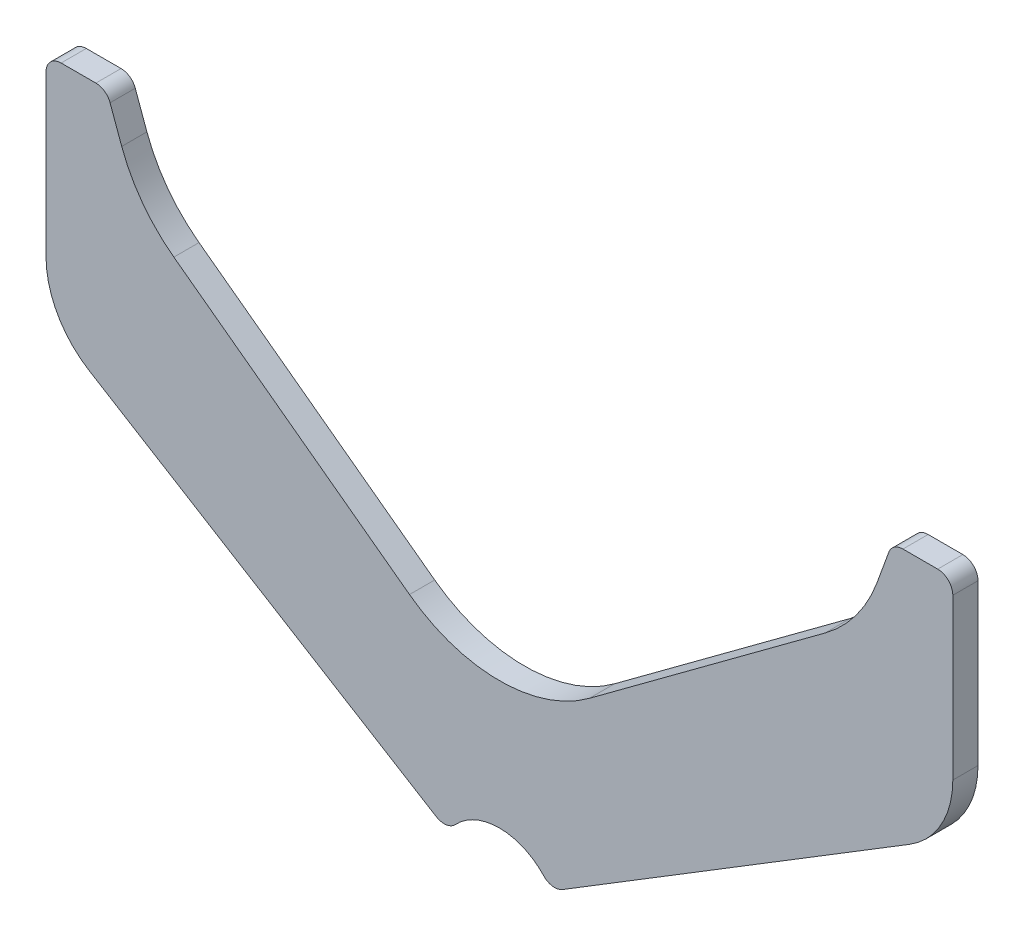
ISO-10303-21;
HEADER;
FILE_DESCRIPTION(('STEP AP214'),'2;1');
FILE_NAME('part.step','',(''),(''),'','','');
FILE_SCHEMA(('AUTOMOTIVE_DESIGN { 1 0 10303 214 1 1 1 1 }'));
ENDSEC;
DATA;
#1=APPLICATION_CONTEXT('core data for automotive mechanical design processes');
#2=APPLICATION_PROTOCOL_DEFINITION('international standard','automotive_design',2000,#1);
#3=PRODUCT_CONTEXT('',#1,'mechanical');
#4=PRODUCT('Part','Part','',(#3));
#5=PRODUCT_RELATED_PRODUCT_CATEGORY('part','',(#4));
#6=PRODUCT_DEFINITION_FORMATION('','',#4);
#7=PRODUCT_DEFINITION_CONTEXT('part definition',#1,'design');
#8=PRODUCT_DEFINITION('design','',#6,#7);
#9=PRODUCT_DEFINITION_SHAPE('','',#8);
#10=(LENGTH_UNIT() NAMED_UNIT(*) SI_UNIT(.MILLI.,.METRE.));
#11=(NAMED_UNIT(*) PLANE_ANGLE_UNIT() SI_UNIT($,.RADIAN.));
#12=(NAMED_UNIT(*) SI_UNIT($,.STERADIAN.) SOLID_ANGLE_UNIT());
#13=UNCERTAINTY_MEASURE_WITH_UNIT(LENGTH_MEASURE(1.E-05),#10,'distance_accuracy_value','');
#14=(GEOMETRIC_REPRESENTATION_CONTEXT(3) GLOBAL_UNCERTAINTY_ASSIGNED_CONTEXT((#13)) GLOBAL_UNIT_ASSIGNED_CONTEXT((#10,
#11,#12)) REPRESENTATION_CONTEXT('',''));
#15=CARTESIAN_POINT('',(0.,0.,0.));
#16=DIRECTION('',(0.,0.,1.));
#17=DIRECTION('',(1.,0.,0.));
#18=AXIS2_PLACEMENT_3D('',#15,#16,#17);
#19=CARTESIAN_POINT('',(-80.1006226146291,97.,5.));
#20=DIRECTION('',(0.,0.,-1.));
#21=DIRECTION('',(-1.,0.,0.));
#22=AXIS2_PLACEMENT_3D('',#19,#20,#21);
#23=CYLINDRICAL_SURFACE('',#22,3.);
#24=CARTESIAN_POINT('',(-80.1006226146291,97.,0.));
#25=DIRECTION('',(0.,0.,1.));
#26=DIRECTION('',(-1.,0.,0.));
#27=AXIS2_PLACEMENT_3D('',#24,#25,#26);
#28=CIRCLE('',#27,3.);
#29=CARTESIAN_POINT('',(-77.2815447522714,98.026060429977,0.));
#30=VERTEX_POINT('',#29);
#31=CARTESIAN_POINT('',(-80.1006226146291,100.,0.));
#32=VERTEX_POINT('',#31);
#33=EDGE_CURVE('E219',#30,#32,#28,.T.);
#34=ORIENTED_EDGE('',*,*,#33,.T.);
#35=DIRECTION('',(0.,0.,-1.));
#36=VECTOR('',#35,1.);
#37=CARTESIAN_POINT('',(-80.1006226146291,100.,5.));
#38=LINE('',#37,#36);
#39=CARTESIAN_POINT('',(-80.1006226146291,100.,5.));
#40=VERTEX_POINT('',#39);
#41=EDGE_CURVE('E11',#40,#32,#38,.T.);
#42=ORIENTED_EDGE('',*,*,#41,.F.);
#43=CARTESIAN_POINT('',(-80.1006226146291,97.,5.));
#44=DIRECTION('',(0.,0.,1.));
#45=DIRECTION('',(-1.,0.,0.));
#46=AXIS2_PLACEMENT_3D('',#43,#44,#45);
#47=CIRCLE('',#46,3.);
#48=CARTESIAN_POINT('',(-77.2815447522714,98.026060429977,5.));
#49=VERTEX_POINT('',#48);
#50=EDGE_CURVE('E261',#49,#40,#47,.T.);
#51=ORIENTED_EDGE('',*,*,#50,.F.);
#52=DIRECTION('',(0.,0.,-1.));
#53=VECTOR('',#52,1.);
#54=CARTESIAN_POINT('',(-77.2815447522714,98.026060429977,5.));
#55=LINE('',#54,#53);
#56=EDGE_CURVE('E215',#49,#30,#55,.T.);
#57=ORIENTED_EDGE('',*,*,#56,.T.);
#58=EDGE_LOOP('',(#34,#42,#51,#57));
#59=FACE_BOUND('',#58,.T.);
#60=ADVANCED_FACE('F39',(#59),#23,.T.);
#61=CARTESIAN_POINT('',(-80.1006226146291,100.,5.));
#62=DIRECTION('',(0.,-1.,0.));
#63=DIRECTION('',(0.,0.,-1.));
#64=AXIS2_PLACEMENT_3D('',#61,#62,#63);
#65=PLANE('',#64);
#66=DIRECTION('',(-1.,0.,0.));
#67=VECTOR('',#66,1.);
#68=CARTESIAN_POINT('',(-80.1006226146291,100.,0.));
#69=LINE('',#68,#67);
#70=CARTESIAN_POINT('',(-87.,100.,0.));
#71=VERTEX_POINT('',#70);
#72=EDGE_CURVE('E222',#32,#71,#69,.T.);
#73=ORIENTED_EDGE('',*,*,#72,.T.);
#74=DIRECTION('',(0.,0.,-1.));
#75=VECTOR('',#74,1.);
#76=CARTESIAN_POINT('',(-87.,100.,5.));
#77=LINE('',#76,#75);
#78=CARTESIAN_POINT('',(-87.,100.,5.));
#79=VERTEX_POINT('',#78);
#80=EDGE_CURVE('E47',#79,#71,#77,.T.);
#81=ORIENTED_EDGE('',*,*,#80,.F.);
#82=DIRECTION('',(-1.,0.,0.));
#83=VECTOR('',#82,1.);
#84=CARTESIAN_POINT('',(-80.1006226146291,100.,5.));
#85=LINE('',#84,#83);
#86=EDGE_CURVE('E140',#40,#79,#85,.T.);
#87=ORIENTED_EDGE('',*,*,#86,.F.);
#88=ORIENTED_EDGE('',*,*,#41,.T.);
#89=EDGE_LOOP('',(#73,#81,#87,#88));
#90=FACE_BOUND('',#89,.T.);
#91=ADVANCED_FACE('F389',(#90),#65,.F.);
#92=CARTESIAN_POINT('',(-87.,97.,5.));
#93=DIRECTION('',(0.,0.,-1.));
#94=DIRECTION('',(-1.,0.,0.));
#95=AXIS2_PLACEMENT_3D('',#92,#93,#94);
#96=CYLINDRICAL_SURFACE('',#95,3.);
#97=CARTESIAN_POINT('',(-87.,97.,0.));
#98=DIRECTION('',(0.,0.,1.));
#99=DIRECTION('',(-1.,0.,0.));
#100=AXIS2_PLACEMENT_3D('',#97,#98,#99);
#101=CIRCLE('',#100,3.);
#102=CARTESIAN_POINT('',(-90.,97.,0.));
#103=VERTEX_POINT('',#102);
#104=EDGE_CURVE('E224',#71,#103,#101,.T.);
#105=ORIENTED_EDGE('',*,*,#104,.T.);
#106=DIRECTION('',(0.,0.,-1.));
#107=VECTOR('',#106,1.);
#108=CARTESIAN_POINT('',(-90.,97.,5.));
#109=LINE('',#108,#107);
#110=CARTESIAN_POINT('',(-90.,97.,5.));
#111=VERTEX_POINT('',#110);
#112=EDGE_CURVE('E310',#111,#103,#109,.T.);
#113=ORIENTED_EDGE('',*,*,#112,.F.);
#114=CARTESIAN_POINT('',(-87.,97.,5.));
#115=DIRECTION('',(0.,0.,1.));
#116=DIRECTION('',(-1.,0.,0.));
#117=AXIS2_PLACEMENT_3D('',#114,#115,#116);
#118=CIRCLE('',#117,3.);
#119=EDGE_CURVE('E318',#79,#111,#118,.T.);
#120=ORIENTED_EDGE('',*,*,#119,.F.);
#121=ORIENTED_EDGE('',*,*,#80,.T.);
#122=EDGE_LOOP('',(#105,#113,#120,#121));
#123=FACE_BOUND('',#122,.T.);
#124=ADVANCED_FACE('F316',(#123),#96,.T.);
#125=CARTESIAN_POINT('',(-90.,97.,5.));
#126=DIRECTION('',(1.,0.,0.));
#127=DIRECTION('',(0.,0.,-1.));
#128=AXIS2_PLACEMENT_3D('',#125,#126,#127);
#129=PLANE('',#128);
#130=DIRECTION('',(0.,-1.,0.));
#131=VECTOR('',#130,1.);
#132=CARTESIAN_POINT('',(-90.,97.,0.));
#133=LINE('',#132,#131);
#134=CARTESIAN_POINT('',(-90.,65.232555285127,0.));
#135=VERTEX_POINT('',#134);
#136=EDGE_CURVE('E226',#103,#135,#133,.T.);
#137=ORIENTED_EDGE('',*,*,#136,.T.);
#138=DIRECTION('',(0.,0.,-1.));
#139=VECTOR('',#138,1.);
#140=CARTESIAN_POINT('',(-90.,65.232555285127,5.));
#141=LINE('',#140,#139);
#142=CARTESIAN_POINT('',(-90.,65.232555285127,5.));
#143=VERTEX_POINT('',#142);
#144=EDGE_CURVE('E307',#143,#135,#141,.T.);
#145=ORIENTED_EDGE('',*,*,#144,.F.);
#146=DIRECTION('',(0.,-1.,0.));
#147=VECTOR('',#146,1.);
#148=CARTESIAN_POINT('',(-90.,97.,5.));
#149=LINE('',#148,#147);
#150=EDGE_CURVE('E336',#111,#143,#149,.T.);
#151=ORIENTED_EDGE('',*,*,#150,.F.);
#152=ORIENTED_EDGE('',*,*,#112,.T.);
#153=EDGE_LOOP('',(#137,#145,#151,#152));
#154=FACE_BOUND('',#153,.T.);
#155=ADVANCED_FACE('F327',(#154),#129,.F.);
#156=CARTESIAN_POINT('',(-72.,65.232555285127,5.));
#157=DIRECTION('',(0.,0.,-1.));
#158=DIRECTION('',(-1.,0.,0.));
#159=AXIS2_PLACEMENT_3D('',#156,#157,#158);
#160=CYLINDRICAL_SURFACE('',#159,18.);
#161=CARTESIAN_POINT('',(-72.,65.232555285127,0.));
#162=DIRECTION('',(0.,0.,1.));
#163=DIRECTION('',(-1.,0.,0.));
#164=AXIS2_PLACEMENT_3D('',#161,#162,#163);
#165=CIRCLE('',#164,18.);
#166=CARTESIAN_POINT('',(-81.404974164887,49.8850323267533,0.));
#167=VERTEX_POINT('',#166);
#168=EDGE_CURVE('E228',#135,#167,#165,.T.);
#169=ORIENTED_EDGE('',*,*,#168,.T.);
#170=DIRECTION('',(0.,0.,-1.));
#171=VECTOR('',#170,1.);
#172=CARTESIAN_POINT('',(-81.404974164887,49.8850323267533,5.));
#173=LINE('',#172,#171);
#174=CARTESIAN_POINT('',(-81.404974164887,49.8850323267533,5.));
#175=VERTEX_POINT('',#174);
#176=EDGE_CURVE('E304',#175,#167,#173,.T.);
#177=ORIENTED_EDGE('',*,*,#176,.F.);
#178=CARTESIAN_POINT('',(-72.,65.232555285127,5.));
#179=DIRECTION('',(0.,0.,1.));
#180=DIRECTION('',(-1.,0.,0.));
#181=AXIS2_PLACEMENT_3D('',#178,#179,#180);
#182=CIRCLE('',#181,18.);
#183=EDGE_CURVE('E333',#143,#175,#182,.T.);
#184=ORIENTED_EDGE('',*,*,#183,.F.);
#185=ORIENTED_EDGE('',*,*,#144,.T.);
#186=EDGE_LOOP('',(#169,#177,#184,#185));
#187=FACE_BOUND('',#186,.T.);
#188=ADVANCED_FACE('F331',(#187),#160,.T.);
#189=CARTESIAN_POINT('',(-81.404974164887,49.8850323267533,5.));
#190=DIRECTION('',(0.522498564715946,0.852640164354094,0.));
#191=DIRECTION('',(-0.852640164354094,0.522498564715946,0.));
#192=AXIS2_PLACEMENT_3D('',#189,#190,#191);
#193=PLANE('',#192);
#194=DIRECTION('',(0.852640164354094,-0.522498564715946,0.));
#195=VECTOR('',#194,1.);
#196=CARTESIAN_POINT('',(-81.404974164887,49.8850323267533,0.));
#197=LINE('',#196,#195);
#198=CARTESIAN_POINT('',(-12.5312000212219,7.67912924934387,0.));
#199=VERTEX_POINT('',#198);
#200=EDGE_CURVE('E230',#167,#199,#197,.T.);
#201=ORIENTED_EDGE('',*,*,#200,.T.);
#202=DIRECTION('',(0.,0.,-1.));
#203=VECTOR('',#202,1.);
#204=CARTESIAN_POINT('',(-12.5312000212219,7.67912924934387,5.));
#205=LINE('',#204,#203);
#206=CARTESIAN_POINT('',(-12.5312000212219,7.67912924934387,5.));
#207=VERTEX_POINT('',#206);
#208=EDGE_CURVE('E301',#207,#199,#205,.T.);
#209=ORIENTED_EDGE('',*,*,#208,.F.);
#210=DIRECTION('',(0.852640164354094,-0.522498564715946,0.));
#211=VECTOR('',#210,1.);
#212=CARTESIAN_POINT('',(-81.404974164887,49.8850323267533,5.));
#213=LINE('',#212,#211);
#214=EDGE_CURVE('E335',#175,#207,#213,.T.);
#215=ORIENTED_EDGE('',*,*,#214,.F.);
#216=ORIENTED_EDGE('',*,*,#176,.T.);
#217=EDGE_LOOP('',(#201,#209,#215,#216));
#218=FACE_BOUND('',#217,.T.);
#219=ADVANCED_FACE('F402',(#218),#193,.F.);
#220=CARTESIAN_POINT('',(-10.963704327074,10.2370497424062,5.));
#221=DIRECTION('',(0.,0.,-1.));
#222=DIRECTION('',(-1.,0.,0.));
#223=AXIS2_PLACEMENT_3D('',#220,#221,#222);
#224=CYLINDRICAL_SURFACE('',#223,3.);
#225=CARTESIAN_POINT('',(-10.963704327074,10.2370497424062,0.));
#226=DIRECTION('',(0.,0.,1.));
#227=DIRECTION('',(1.,0.,0.));
#228=AXIS2_PLACEMENT_3D('',#225,#226,#227);
#229=CIRCLE('',#228,3.);
#230=CARTESIAN_POINT('',(-8.77096346165923,8.18963979392492,0.));
#231=VERTEX_POINT('',#230);
#232=EDGE_CURVE('E232',#199,#231,#229,.T.);
#233=ORIENTED_EDGE('',*,*,#232,.T.);
#234=DIRECTION('',(0.,0.,-1.));
#235=VECTOR('',#234,1.);
#236=CARTESIAN_POINT('',(-8.77096346165923,8.18963979392492,5.));
#237=LINE('',#236,#235);
#238=CARTESIAN_POINT('',(-8.77096346165923,8.18963979392492,5.));
#239=VERTEX_POINT('',#238);
#240=EDGE_CURVE('E298',#239,#231,#237,.T.);
#241=ORIENTED_EDGE('',*,*,#240,.F.);
#242=CARTESIAN_POINT('',(-10.963704327074,10.2370497424062,5.));
#243=DIRECTION('',(0.,0.,1.));
#244=DIRECTION('',(1.,0.,0.));
#245=AXIS2_PLACEMENT_3D('',#242,#243,#244);
#246=CIRCLE('',#245,3.);
#247=EDGE_CURVE('E338',#207,#239,#246,.T.);
#248=ORIENTED_EDGE('',*,*,#247,.F.);
#249=ORIENTED_EDGE('',*,*,#208,.T.);
#250=EDGE_LOOP('',(#233,#241,#248,#249));
#251=FACE_BOUND('',#250,.T.);
#252=ADVANCED_FACE('F405',(#251),#224,.T.);
#253=CARTESIAN_POINT('',(0.,0.,5.));
#254=DIRECTION('',(0.,0.,-1.));
#255=DIRECTION('',(-1.,0.,0.));
#256=AXIS2_PLACEMENT_3D('',#253,#254,#255);
#257=CYLINDRICAL_SURFACE('',#256,12.);
#258=CARTESIAN_POINT('',(0.,0.,0.));
#259=DIRECTION('',(0.,0.,-1.));
#260=DIRECTION('',(1.,0.,0.));
#261=AXIS2_PLACEMENT_3D('',#258,#259,#260);
#262=CIRCLE('',#261,12.);
#263=CARTESIAN_POINT('',(8.77096346165926,8.18963979392491,0.));
#264=VERTEX_POINT('',#263);
#265=EDGE_CURVE('E234',#231,#264,#262,.T.);
#266=ORIENTED_EDGE('',*,*,#265,.T.);
#267=DIRECTION('',(0.,0.,-1.));
#268=VECTOR('',#267,1.);
#269=CARTESIAN_POINT('',(8.77096346165926,8.18963979392491,5.));
#270=LINE('',#269,#268);
#271=CARTESIAN_POINT('',(8.77096346165926,8.18963979392491,5.));
#272=VERTEX_POINT('',#271);
#273=EDGE_CURVE('E295',#272,#264,#270,.T.);
#274=ORIENTED_EDGE('',*,*,#273,.F.);
#275=CARTESIAN_POINT('',(0.,0.,5.));
#276=DIRECTION('',(0.,0.,-1.));
#277=DIRECTION('',(1.,0.,0.));
#278=AXIS2_PLACEMENT_3D('',#275,#276,#277);
#279=CIRCLE('',#278,12.);
#280=EDGE_CURVE('E344',#239,#272,#279,.T.);
#281=ORIENTED_EDGE('',*,*,#280,.F.);
#282=ORIENTED_EDGE('',*,*,#240,.T.);
#283=EDGE_LOOP('',(#266,#274,#281,#282));
#284=FACE_BOUND('',#283,.T.);
#285=ADVANCED_FACE('F409',(#284),#257,.F.);
#286=CARTESIAN_POINT('',(10.9637043270741,10.2370497424062,5.));
#287=DIRECTION('',(0.,0.,-1.));
#288=DIRECTION('',(-1.,0.,0.));
#289=AXIS2_PLACEMENT_3D('',#286,#287,#288);
#290=CYLINDRICAL_SURFACE('',#289,3.);
#291=CARTESIAN_POINT('',(10.9637043270741,10.2370497424062,0.));
#292=DIRECTION('',(0.,0.,1.));
#293=DIRECTION('',(-1.,0.,0.));
#294=AXIS2_PLACEMENT_3D('',#291,#292,#293);
#295=CIRCLE('',#294,3.);
#296=CARTESIAN_POINT('',(12.5312000212219,7.67912924934388,0.));
#297=VERTEX_POINT('',#296);
#298=EDGE_CURVE('E236',#264,#297,#295,.T.);
#299=ORIENTED_EDGE('',*,*,#298,.T.);
#300=DIRECTION('',(0.,0.,-1.));
#301=VECTOR('',#300,1.);
#302=CARTESIAN_POINT('',(12.5312000212219,7.67912924934388,5.));
#303=LINE('',#302,#301);
#304=CARTESIAN_POINT('',(12.5312000212219,7.67912924934388,5.));
#305=VERTEX_POINT('',#304);
#306=EDGE_CURVE('E292',#305,#297,#303,.T.);
#307=ORIENTED_EDGE('',*,*,#306,.F.);
#308=CARTESIAN_POINT('',(10.9637043270741,10.2370497424062,5.));
#309=DIRECTION('',(0.,0.,1.));
#310=DIRECTION('',(-1.,0.,0.));
#311=AXIS2_PLACEMENT_3D('',#308,#309,#310);
#312=CIRCLE('',#311,3.);
#313=EDGE_CURVE('E346',#272,#305,#312,.T.);
#314=ORIENTED_EDGE('',*,*,#313,.F.);
#315=ORIENTED_EDGE('',*,*,#273,.T.);
#316=EDGE_LOOP('',(#299,#307,#314,#315));
#317=FACE_BOUND('',#316,.T.);
#318=ADVANCED_FACE('F413',(#317),#290,.T.);
#319=CARTESIAN_POINT('',(81.4049741648871,49.8850323267533,5.));
#320=DIRECTION('',(-0.522498564715947,0.852640164354094,0.));
#321=DIRECTION('',(-0.852640164354094,-0.522498564715947,0.));
#322=AXIS2_PLACEMENT_3D('',#319,#320,#321);
#323=PLANE('',#322);
#324=DIRECTION('',(0.852640164354094,0.522498564715947,0.));
#325=VECTOR('',#324,1.);
#326=CARTESIAN_POINT('',(81.4049741648871,49.8850323267533,0.));
#327=LINE('',#326,#325);
#328=CARTESIAN_POINT('',(81.4049741648871,49.8850323267533,0.));
#329=VERTEX_POINT('',#328);
#330=EDGE_CURVE('E238',#297,#329,#327,.T.);
#331=ORIENTED_EDGE('',*,*,#330,.T.);
#332=DIRECTION('',(0.,0.,-1.));
#333=VECTOR('',#332,1.);
#334=CARTESIAN_POINT('',(81.4049741648871,49.8850323267533,5.));
#335=LINE('',#334,#333);
#336=CARTESIAN_POINT('',(81.4049741648871,49.8850323267533,5.));
#337=VERTEX_POINT('',#336);
#338=EDGE_CURVE('E289',#337,#329,#335,.T.);
#339=ORIENTED_EDGE('',*,*,#338,.F.);
#340=DIRECTION('',(0.852640164354094,0.522498564715947,0.));
#341=VECTOR('',#340,1.);
#342=CARTESIAN_POINT('',(81.4049741648871,49.8850323267533,5.));
#343=LINE('',#342,#341);
#344=EDGE_CURVE('E348',#305,#337,#343,.T.);
#345=ORIENTED_EDGE('',*,*,#344,.F.);
#346=ORIENTED_EDGE('',*,*,#306,.T.);
#347=EDGE_LOOP('',(#331,#339,#345,#346));
#348=FACE_BOUND('',#347,.T.);
#349=ADVANCED_FACE('F417',(#348),#323,.F.);
#350=CARTESIAN_POINT('',(72.,65.232555285127,5.));
#351=DIRECTION('',(0.,0.,-1.));
#352=DIRECTION('',(-1.,0.,0.));
#353=AXIS2_PLACEMENT_3D('',#350,#351,#352);
#354=CYLINDRICAL_SURFACE('',#353,18.);
#355=CARTESIAN_POINT('',(72.,65.232555285127,0.));
#356=DIRECTION('',(0.,0.,1.));
#357=DIRECTION('',(-1.,0.,0.));
#358=AXIS2_PLACEMENT_3D('',#355,#356,#357);
#359=CIRCLE('',#358,18.);
#360=CARTESIAN_POINT('',(90.,65.232555285127,0.));
#361=VERTEX_POINT('',#360);
#362=EDGE_CURVE('E240',#329,#361,#359,.T.);
#363=ORIENTED_EDGE('',*,*,#362,.T.);
#364=DIRECTION('',(0.,0.,-1.));
#365=VECTOR('',#364,1.);
#366=CARTESIAN_POINT('',(90.,65.232555285127,5.));
#367=LINE('',#366,#365);
#368=CARTESIAN_POINT('',(90.,65.232555285127,5.));
#369=VERTEX_POINT('',#368);
#370=EDGE_CURVE('E286',#369,#361,#367,.T.);
#371=ORIENTED_EDGE('',*,*,#370,.F.);
#372=CARTESIAN_POINT('',(72.,65.232555285127,5.));
#373=DIRECTION('',(0.,0.,1.));
#374=DIRECTION('',(-1.,0.,0.));
#375=AXIS2_PLACEMENT_3D('',#372,#373,#374);
#376=CIRCLE('',#375,18.);
#377=EDGE_CURVE('E350',#337,#369,#376,.T.);
#378=ORIENTED_EDGE('',*,*,#377,.F.);
#379=ORIENTED_EDGE('',*,*,#338,.T.);
#380=EDGE_LOOP('',(#363,#371,#378,#379));
#381=FACE_BOUND('',#380,.T.);
#382=ADVANCED_FACE('F421',(#381),#354,.T.);
#383=CARTESIAN_POINT('',(90.,97.,5.));
#384=DIRECTION('',(-1.,0.,0.));
#385=DIRECTION('',(0.,0.,1.));
#386=AXIS2_PLACEMENT_3D('',#383,#384,#385);
#387=PLANE('',#386);
#388=DIRECTION('',(0.,1.,0.));
#389=VECTOR('',#388,1.);
#390=CARTESIAN_POINT('',(90.,97.,0.));
#391=LINE('',#390,#389);
#392=CARTESIAN_POINT('',(90.,97.,0.));
#393=VERTEX_POINT('',#392);
#394=EDGE_CURVE('E242',#361,#393,#391,.T.);
#395=ORIENTED_EDGE('',*,*,#394,.T.);
#396=DIRECTION('',(0.,0.,-1.));
#397=VECTOR('',#396,1.);
#398=CARTESIAN_POINT('',(90.,97.,5.));
#399=LINE('',#398,#397);
#400=CARTESIAN_POINT('',(90.,97.,5.));
#401=VERTEX_POINT('',#400);
#402=EDGE_CURVE('E283',#401,#393,#399,.T.);
#403=ORIENTED_EDGE('',*,*,#402,.F.);
#404=DIRECTION('',(0.,1.,0.));
#405=VECTOR('',#404,1.);
#406=CARTESIAN_POINT('',(90.,97.,5.));
#407=LINE('',#406,#405);
#408=EDGE_CURVE('E352',#369,#401,#407,.T.);
#409=ORIENTED_EDGE('',*,*,#408,.F.);
#410=ORIENTED_EDGE('',*,*,#370,.T.);
#411=EDGE_LOOP('',(#395,#403,#409,#410));
#412=FACE_BOUND('',#411,.T.);
#413=ADVANCED_FACE('F425',(#412),#387,.F.);
#414=CARTESIAN_POINT('',(87.,97.,5.));
#415=DIRECTION('',(0.,0.,-1.));
#416=DIRECTION('',(-1.,0.,0.));
#417=AXIS2_PLACEMENT_3D('',#414,#415,#416);
#418=CYLINDRICAL_SURFACE('',#417,3.);
#419=CARTESIAN_POINT('',(87.,97.,0.));
#420=DIRECTION('',(0.,0.,1.));
#421=DIRECTION('',(1.,0.,0.));
#422=AXIS2_PLACEMENT_3D('',#419,#420,#421);
#423=CIRCLE('',#422,3.);
#424=CARTESIAN_POINT('',(87.,100.,0.));
#425=VERTEX_POINT('',#424);
#426=EDGE_CURVE('E244',#393,#425,#423,.T.);
#427=ORIENTED_EDGE('',*,*,#426,.T.);
#428=DIRECTION('',(0.,0.,-1.));
#429=VECTOR('',#428,1.);
#430=CARTESIAN_POINT('',(87.,100.,5.));
#431=LINE('',#430,#429);
#432=CARTESIAN_POINT('',(87.,100.,5.));
#433=VERTEX_POINT('',#432);
#434=EDGE_CURVE('E280',#433,#425,#431,.T.);
#435=ORIENTED_EDGE('',*,*,#434,.F.);
#436=CARTESIAN_POINT('',(87.,97.,5.));
#437=DIRECTION('',(0.,0.,1.));
#438=DIRECTION('',(1.,0.,0.));
#439=AXIS2_PLACEMENT_3D('',#436,#437,#438);
#440=CIRCLE('',#439,3.);
#441=EDGE_CURVE('E354',#401,#433,#440,.T.);
#442=ORIENTED_EDGE('',*,*,#441,.F.);
#443=ORIENTED_EDGE('',*,*,#402,.T.);
#444=EDGE_LOOP('',(#427,#435,#442,#443));
#445=FACE_BOUND('',#444,.T.);
#446=ADVANCED_FACE('F429',(#445),#418,.T.);
#447=CARTESIAN_POINT('',(80.1006226146291,100.,5.));
#448=DIRECTION('',(0.,-1.,0.));
#449=DIRECTION('',(1.,0.,0.));
#450=AXIS2_PLACEMENT_3D('',#447,#448,#449);
#451=PLANE('',#450);
#452=DIRECTION('',(-1.,0.,0.));
#453=VECTOR('',#452,1.);
#454=CARTESIAN_POINT('',(80.1006226146291,100.,0.));
#455=LINE('',#454,#453);
#456=CARTESIAN_POINT('',(80.1006226146291,100.,0.));
#457=VERTEX_POINT('',#456);
#458=EDGE_CURVE('E246',#425,#457,#455,.T.);
#459=ORIENTED_EDGE('',*,*,#458,.T.);
#460=DIRECTION('',(0.,0.,-1.));
#461=VECTOR('',#460,1.);
#462=CARTESIAN_POINT('',(80.1006226146291,100.,5.));
#463=LINE('',#462,#461);
#464=CARTESIAN_POINT('',(80.1006226146291,100.,5.));
#465=VERTEX_POINT('',#464);
#466=EDGE_CURVE('E277',#465,#457,#463,.T.);
#467=ORIENTED_EDGE('',*,*,#466,.F.);
#468=DIRECTION('',(-1.,0.,0.));
#469=VECTOR('',#468,1.);
#470=CARTESIAN_POINT('',(80.1006226146291,100.,5.));
#471=LINE('',#470,#469);
#472=EDGE_CURVE('E356',#433,#465,#471,.T.);
#473=ORIENTED_EDGE('',*,*,#472,.F.);
#474=ORIENTED_EDGE('',*,*,#434,.T.);
#475=EDGE_LOOP('',(#459,#467,#473,#474));
#476=FACE_BOUND('',#475,.T.);
#477=ADVANCED_FACE('F433',(#476),#451,.F.);
#478=CARTESIAN_POINT('',(80.1006226146291,97.,5.));
#479=DIRECTION('',(0.,0.,-1.));
#480=DIRECTION('',(-1.,0.,0.));
#481=AXIS2_PLACEMENT_3D('',#478,#479,#480);
#482=CYLINDRICAL_SURFACE('',#481,3.);
#483=CARTESIAN_POINT('',(80.1006226146291,97.,0.));
#484=DIRECTION('',(0.,0.,1.));
#485=DIRECTION('',(-1.,0.,0.));
#486=AXIS2_PLACEMENT_3D('',#483,#484,#485);
#487=CIRCLE('',#486,3.);
#488=CARTESIAN_POINT('',(77.2815447522714,98.026060429977,0.));
#489=VERTEX_POINT('',#488);
#490=EDGE_CURVE('E248',#457,#489,#487,.T.);
#491=ORIENTED_EDGE('',*,*,#490,.T.);
#492=DIRECTION('',(0.,0.,-1.));
#493=VECTOR('',#492,1.);
#494=CARTESIAN_POINT('',(77.2815447522714,98.026060429977,5.));
#495=LINE('',#494,#493);
#496=CARTESIAN_POINT('',(77.2815447522714,98.026060429977,5.));
#497=VERTEX_POINT('',#496);
#498=EDGE_CURVE('E274',#497,#489,#495,.T.);
#499=ORIENTED_EDGE('',*,*,#498,.F.);
#500=CARTESIAN_POINT('',(80.1006226146291,97.,5.));
#501=DIRECTION('',(0.,0.,1.));
#502=DIRECTION('',(-1.,0.,0.));
#503=AXIS2_PLACEMENT_3D('',#500,#501,#502);
#504=CIRCLE('',#503,3.);
#505=EDGE_CURVE('E358',#465,#497,#504,.T.);
#506=ORIENTED_EDGE('',*,*,#505,.F.);
#507=ORIENTED_EDGE('',*,*,#466,.T.);
#508=EDGE_LOOP('',(#491,#499,#506,#507));
#509=FACE_BOUND('',#508,.T.);
#510=ADVANCED_FACE('F437',(#509),#482,.T.);
#511=CARTESIAN_POINT('',(74.9695677746102,91.6739558895538,5.));
#512=DIRECTION('',(0.93969262078591,-0.342020143325663,0.));
#513=DIRECTION('',(0.342020143325663,0.939692620785911,0.));
#514=AXIS2_PLACEMENT_3D('',#511,#512,#513);
#515=PLANE('',#514);
#516=DIRECTION('',(-0.342020143325663,-0.93969262078591,0.));
#517=VECTOR('',#516,1.);
#518=CARTESIAN_POINT('',(74.9695677746102,91.6739558895538,0.));
#519=LINE('',#518,#517);
#520=CARTESIAN_POINT('',(74.9695677746102,91.6739558895538,0.));
#521=VERTEX_POINT('',#520);
#522=EDGE_CURVE('E250',#489,#521,#519,.T.);
#523=ORIENTED_EDGE('',*,*,#522,.T.);
#524=DIRECTION('',(0.,0.,-1.));
#525=VECTOR('',#524,1.);
#526=CARTESIAN_POINT('',(74.9695677746102,91.6739558895538,5.));
#527=LINE('',#526,#525);
#528=CARTESIAN_POINT('',(74.9695677746102,91.6739558895538,5.));
#529=VERTEX_POINT('',#528);
#530=EDGE_CURVE('E271',#529,#521,#527,.T.);
#531=ORIENTED_EDGE('',*,*,#530,.F.);
#532=DIRECTION('',(-0.342020143325663,-0.93969262078591,0.));
#533=VECTOR('',#532,1.);
#534=CARTESIAN_POINT('',(74.9695677746102,91.6739558895538,5.));
#535=LINE('',#534,#533);
#536=EDGE_CURVE('E360',#497,#529,#535,.T.);
#537=ORIENTED_EDGE('',*,*,#536,.F.);
#538=ORIENTED_EDGE('',*,*,#498,.T.);
#539=EDGE_LOOP('',(#523,#531,#537,#538));
#540=FACE_BOUND('',#539,.T.);
#541=ADVANCED_FACE('F441',(#540),#515,.F.);
#542=CARTESIAN_POINT('',(46.7787891510329,101.934560189324,5.));
#543=DIRECTION('',(0.,0.,-1.));
#544=DIRECTION('',(-1.,0.,0.));
#545=AXIS2_PLACEMENT_3D('',#542,#543,#544);
#546=CYLINDRICAL_SURFACE('',#545,30.);
#547=CARTESIAN_POINT('',(46.7787891510329,101.934560189324,0.));
#548=DIRECTION('',(0.,0.,-1.));
#549=DIRECTION('',(1.,0.,0.));
#550=AXIS2_PLACEMENT_3D('',#547,#548,#549);
#551=CIRCLE('',#550,30.);
#552=CARTESIAN_POINT('',(64.6234727535727,77.8188543708068,0.));
#553=VERTEX_POINT('',#552);
#554=EDGE_CURVE('E252',#521,#553,#551,.T.);
#555=ORIENTED_EDGE('',*,*,#554,.T.);
#556=DIRECTION('',(0.,0.,-1.));
#557=VECTOR('',#556,1.);
#558=CARTESIAN_POINT('',(64.6234727535727,77.8188543708068,5.));
#559=LINE('',#558,#557);
#560=CARTESIAN_POINT('',(64.6234727535727,77.8188543708068,5.));
#561=VERTEX_POINT('',#560);
#562=EDGE_CURVE('E268',#561,#553,#559,.T.);
#563=ORIENTED_EDGE('',*,*,#562,.F.);
#564=CARTESIAN_POINT('',(46.7787891510329,101.934560189324,5.));
#565=DIRECTION('',(0.,0.,-1.));
#566=DIRECTION('',(1.,0.,0.));
#567=AXIS2_PLACEMENT_3D('',#564,#565,#566);
#568=CIRCLE('',#567,30.);
#569=EDGE_CURVE('E362',#529,#561,#568,.T.);
#570=ORIENTED_EDGE('',*,*,#569,.F.);
#571=ORIENTED_EDGE('',*,*,#530,.T.);
#572=EDGE_LOOP('',(#555,#563,#570,#571));
#573=FACE_BOUND('',#572,.T.);
#574=ADVANCED_FACE('F445',(#573),#546,.F.);
#575=CARTESIAN_POINT('',(17.84468360254,43.2043712620785,5.));
#576=DIRECTION('',(0.594822786751333,-0.803856860617224,0.));
#577=DIRECTION('',(0.803856860617224,0.594822786751333,0.));
#578=AXIS2_PLACEMENT_3D('',#575,#576,#577);
#579=PLANE('',#578);
#580=DIRECTION('',(-0.803856860617224,-0.594822786751333,0.));
#581=VECTOR('',#580,1.);
#582=CARTESIAN_POINT('',(17.84468360254,43.2043712620785,0.));
#583=LINE('',#582,#581);
#584=CARTESIAN_POINT('',(17.84468360254,43.2043712620785,0.));
#585=VERTEX_POINT('',#584);
#586=EDGE_CURVE('E254',#553,#585,#583,.T.);
#587=ORIENTED_EDGE('',*,*,#586,.T.);
#588=DIRECTION('',(0.,0.,-1.));
#589=VECTOR('',#588,1.);
#590=CARTESIAN_POINT('',(17.84468360254,43.2043712620785,5.));
#591=LINE('',#590,#589);
#592=CARTESIAN_POINT('',(17.84468360254,43.2043712620785,5.));
#593=VERTEX_POINT('',#592);
#594=EDGE_CURVE('E265',#593,#585,#591,.T.);
#595=ORIENTED_EDGE('',*,*,#594,.F.);
#596=DIRECTION('',(-0.803856860617224,-0.594822786751333,0.));
#597=VECTOR('',#596,1.);
#598=CARTESIAN_POINT('',(17.84468360254,43.2043712620785,5.));
#599=LINE('',#598,#597);
#600=EDGE_CURVE('E364',#561,#593,#599,.T.);
#601=ORIENTED_EDGE('',*,*,#600,.F.);
#602=ORIENTED_EDGE('',*,*,#562,.T.);
#603=EDGE_LOOP('',(#587,#595,#601,#602));
#604=FACE_BOUND('',#603,.T.);
#605=ADVANCED_FACE('F370',(#604),#579,.F.);
#606=CARTESIAN_POINT('',(0.,67.3200770805951,5.));
#607=DIRECTION('',(0.,0.,-1.));
#608=DIRECTION('',(-1.,0.,0.));
#609=AXIS2_PLACEMENT_3D('',#606,#607,#608);
#610=CYLINDRICAL_SURFACE('',#609,30.);
#611=CARTESIAN_POINT('',(0.,67.3200770805951,0.));
#612=DIRECTION('',(0.,0.,-1.));
#613=DIRECTION('',(-1.,0.,0.));
#614=AXIS2_PLACEMENT_3D('',#611,#612,#613);
#615=CIRCLE('',#614,30.);
#616=CARTESIAN_POINT('',(-17.84468360254,43.2043712620785,0.));
#617=VERTEX_POINT('',#616);
#618=EDGE_CURVE('E256',#585,#617,#615,.T.);
#619=ORIENTED_EDGE('',*,*,#618,.T.);
#620=DIRECTION('',(0.,0.,-1.));
#621=VECTOR('',#620,1.);
#622=CARTESIAN_POINT('',(-17.84468360254,43.2043712620785,5.));
#623=LINE('',#622,#621);
#624=CARTESIAN_POINT('',(-17.84468360254,43.2043712620785,5.));
#625=VERTEX_POINT('',#624);
#626=EDGE_CURVE('E210',#625,#617,#623,.T.);
#627=ORIENTED_EDGE('',*,*,#626,.F.);
#628=CARTESIAN_POINT('',(0.,67.3200770805951,5.));
#629=DIRECTION('',(0.,0.,-1.));
#630=DIRECTION('',(-1.,0.,0.));
#631=AXIS2_PLACEMENT_3D('',#628,#629,#630);
#632=CIRCLE('',#631,30.);
#633=EDGE_CURVE('E201',#593,#625,#632,.T.);
#634=ORIENTED_EDGE('',*,*,#633,.F.);
#635=ORIENTED_EDGE('',*,*,#594,.T.);
#636=EDGE_LOOP('',(#619,#627,#634,#635));
#637=FACE_BOUND('',#636,.T.);
#638=ADVANCED_FACE('F374',(#637),#610,.F.);
#639=CARTESIAN_POINT('',(-17.84468360254,43.2043712620785,5.));
#640=DIRECTION('',(-0.594822786751333,-0.803856860617224,0.));
#641=DIRECTION('',(0.803856860617224,-0.594822786751333,0.));
#642=AXIS2_PLACEMENT_3D('',#639,#640,#641);
#643=PLANE('',#642);
#644=DIRECTION('',(-0.803856860617224,0.594822786751333,0.));
#645=VECTOR('',#644,1.);
#646=CARTESIAN_POINT('',(-17.84468360254,43.2043712620785,0.));
#647=LINE('',#646,#645);
#648=CARTESIAN_POINT('',(-64.6234727535729,77.8188543708069,0.));
#649=VERTEX_POINT('',#648);
#650=EDGE_CURVE('E209',#617,#649,#647,.T.);
#651=ORIENTED_EDGE('',*,*,#650,.T.);
#652=DIRECTION('',(0.,0.,-1.));
#653=VECTOR('',#652,1.);
#654=CARTESIAN_POINT('',(-64.6234727535729,77.8188543708069,5.));
#655=LINE('',#654,#653);
#656=CARTESIAN_POINT('',(-64.6234727535729,77.8188543708069,5.));
#657=VERTEX_POINT('',#656);
#658=EDGE_CURVE('E206',#657,#649,#655,.T.);
#659=ORIENTED_EDGE('',*,*,#658,.F.);
#660=DIRECTION('',(-0.803856860617224,0.594822786751333,0.));
#661=VECTOR('',#660,1.);
#662=CARTESIAN_POINT('',(-17.84468360254,43.2043712620785,5.));
#663=LINE('',#662,#661);
#664=EDGE_CURVE('E195',#625,#657,#663,.T.);
#665=ORIENTED_EDGE('',*,*,#664,.F.);
#666=ORIENTED_EDGE('',*,*,#626,.T.);
#667=EDGE_LOOP('',(#651,#659,#665,#666));
#668=FACE_BOUND('',#667,.T.);
#669=ADVANCED_FACE('F207',(#668),#643,.F.);
#670=CARTESIAN_POINT('',(-46.7787891510329,101.934560189324,5.));
#671=DIRECTION('',(0.,0.,-1.));
#672=DIRECTION('',(-1.,0.,0.));
#673=AXIS2_PLACEMENT_3D('',#670,#671,#672);
#674=CYLINDRICAL_SURFACE('',#673,30.);
#675=CARTESIAN_POINT('',(-46.7787891510329,101.934560189324,0.));
#676=DIRECTION('',(0.,0.,-1.));
#677=DIRECTION('',(1.,0.,0.));
#678=AXIS2_PLACEMENT_3D('',#675,#676,#677);
#679=CIRCLE('',#678,30.);
#680=CARTESIAN_POINT('',(-74.9695677746102,91.6739558895538,0.));
#681=VERTEX_POINT('',#680);
#682=EDGE_CURVE('E126',#649,#681,#679,.T.);
#683=ORIENTED_EDGE('',*,*,#682,.T.);
#684=DIRECTION('',(0.,0.,-1.));
#685=VECTOR('',#684,1.);
#686=CARTESIAN_POINT('',(-74.9695677746102,91.6739558895538,5.));
#687=LINE('',#686,#685);
#688=CARTESIAN_POINT('',(-74.9695677746102,91.6739558895538,5.));
#689=VERTEX_POINT('',#688);
#690=EDGE_CURVE('E211',#689,#681,#687,.T.);
#691=ORIENTED_EDGE('',*,*,#690,.F.);
#692=CARTESIAN_POINT('',(-46.7787891510329,101.934560189324,5.));
#693=DIRECTION('',(0.,0.,-1.));
#694=DIRECTION('',(1.,0.,0.));
#695=AXIS2_PLACEMENT_3D('',#692,#693,#694);
#696=CIRCLE('',#695,30.);
#697=EDGE_CURVE('E199',#657,#689,#696,.T.);
#698=ORIENTED_EDGE('',*,*,#697,.F.);
#699=ORIENTED_EDGE('',*,*,#658,.T.);
#700=EDGE_LOOP('',(#683,#691,#698,#699));
#701=FACE_BOUND('',#700,.T.);
#702=ADVANCED_FACE('F213',(#701),#674,.F.);
#703=CARTESIAN_POINT('',(-74.9695677746102,91.6739558895538,5.));
#704=DIRECTION('',(-0.93969262078591,-0.342020143325663,0.));
#705=DIRECTION('',(0.342020143325663,-0.939692620785911,0.));
#706=AXIS2_PLACEMENT_3D('',#703,#704,#705);
#707=PLANE('',#706);
#708=DIRECTION('',(-0.342020143325663,0.93969262078591,0.));
#709=VECTOR('',#708,1.);
#710=CARTESIAN_POINT('',(-74.9695677746102,91.6739558895538,0.));
#711=LINE('',#710,#709);
#712=EDGE_CURVE('E132',#681,#30,#711,.T.);
#713=ORIENTED_EDGE('',*,*,#712,.T.);
#714=ORIENTED_EDGE('',*,*,#56,.F.);
#715=DIRECTION('',(-0.342020143325663,0.93969262078591,0.));
#716=VECTOR('',#715,1.);
#717=CARTESIAN_POINT('',(-74.9695677746102,91.6739558895538,5.));
#718=LINE('',#717,#716);
#719=EDGE_CURVE('E55',#689,#49,#718,.T.);
#720=ORIENTED_EDGE('',*,*,#719,.F.);
#721=ORIENTED_EDGE('',*,*,#690,.T.);
#722=EDGE_LOOP('',(#713,#714,#720,#721));
#723=FACE_BOUND('',#722,.T.);
#724=ADVANCED_FACE('F378',(#723),#707,.F.);
#725=CARTESIAN_POINT('',(-80.1006226146291,97.,5.));
#726=DIRECTION('',(0.,0.,-1.));
#727=DIRECTION('',(-1.,0.,0.));
#728=AXIS2_PLACEMENT_3D('',#725,#726,#727);
#729=PLANE('',#728);
#730=ORIENTED_EDGE('',*,*,#50,.T.);
#731=ORIENTED_EDGE('',*,*,#86,.T.);
#732=ORIENTED_EDGE('',*,*,#119,.T.);
#733=ORIENTED_EDGE('',*,*,#150,.T.);
#734=ORIENTED_EDGE('',*,*,#183,.T.);
#735=ORIENTED_EDGE('',*,*,#214,.T.);
#736=ORIENTED_EDGE('',*,*,#247,.T.);
#737=ORIENTED_EDGE('',*,*,#280,.T.);
#738=ORIENTED_EDGE('',*,*,#313,.T.);
#739=ORIENTED_EDGE('',*,*,#344,.T.);
#740=ORIENTED_EDGE('',*,*,#377,.T.);
#741=ORIENTED_EDGE('',*,*,#408,.T.);
#742=ORIENTED_EDGE('',*,*,#441,.T.);
#743=ORIENTED_EDGE('',*,*,#472,.T.);
#744=ORIENTED_EDGE('',*,*,#505,.T.);
#745=ORIENTED_EDGE('',*,*,#536,.T.);
#746=ORIENTED_EDGE('',*,*,#569,.T.);
#747=ORIENTED_EDGE('',*,*,#600,.T.);
#748=ORIENTED_EDGE('',*,*,#633,.T.);
#749=ORIENTED_EDGE('',*,*,#664,.T.);
#750=ORIENTED_EDGE('',*,*,#697,.T.);
#751=ORIENTED_EDGE('',*,*,#719,.T.);
#752=EDGE_LOOP('',(#730,#731,#732,#733,#734,#735,#736,#737,#738,#739,#740,#741,#742,#743,#744,
#745,#746,#747,#748,#749,#750,#751));
#753=FACE_BOUND('',#752,.T.);
#754=ADVANCED_FACE('F197',(#753),#729,.F.);
#755=CARTESIAN_POINT('',(-80.1006226146291,97.,0.));
#756=DIRECTION('',(0.,0.,-1.));
#757=DIRECTION('',(-1.,0.,0.));
#758=AXIS2_PLACEMENT_3D('',#755,#756,#757);
#759=PLANE('',#758);
#760=ORIENTED_EDGE('',*,*,#33,.F.);
#761=ORIENTED_EDGE('',*,*,#712,.F.);
#762=ORIENTED_EDGE('',*,*,#682,.F.);
#763=ORIENTED_EDGE('',*,*,#650,.F.);
#764=ORIENTED_EDGE('',*,*,#618,.F.);
#765=ORIENTED_EDGE('',*,*,#586,.F.);
#766=ORIENTED_EDGE('',*,*,#554,.F.);
#767=ORIENTED_EDGE('',*,*,#522,.F.);
#768=ORIENTED_EDGE('',*,*,#490,.F.);
#769=ORIENTED_EDGE('',*,*,#458,.F.);
#770=ORIENTED_EDGE('',*,*,#426,.F.);
#771=ORIENTED_EDGE('',*,*,#394,.F.);
#772=ORIENTED_EDGE('',*,*,#362,.F.);
#773=ORIENTED_EDGE('',*,*,#330,.F.);
#774=ORIENTED_EDGE('',*,*,#298,.F.);
#775=ORIENTED_EDGE('',*,*,#265,.F.);
#776=ORIENTED_EDGE('',*,*,#232,.F.);
#777=ORIENTED_EDGE('',*,*,#200,.F.);
#778=ORIENTED_EDGE('',*,*,#168,.F.);
#779=ORIENTED_EDGE('',*,*,#136,.F.);
#780=ORIENTED_EDGE('',*,*,#104,.F.);
#781=ORIENTED_EDGE('',*,*,#72,.F.);
#782=EDGE_LOOP('',(#760,#761,#762,#763,#764,#765,#766,#767,#768,#769,#770,#771,#772,#773,#774,
#775,#776,#777,#778,#779,#780,#781));
#783=FACE_BOUND('',#782,.T.);
#784=ADVANCED_FACE('F322',(#783),#759,.T.);
#785=CLOSED_SHELL('',(#60,#91,#124,#155,#188,#219,#252,#285,#318,#349,#382,#413,#446,#477,#510,
#541,#574,#605,#638,#669,#702,#724,#754,#784));
#786=MANIFOLD_SOLID_BREP('B2',#785);
#787=ADVANCED_BREP_SHAPE_REPRESENTATION('',(#18,#786),#14);
#788=SHAPE_DEFINITION_REPRESENTATION(#9,#787);
ENDSEC;
END-ISO-10303-21;
